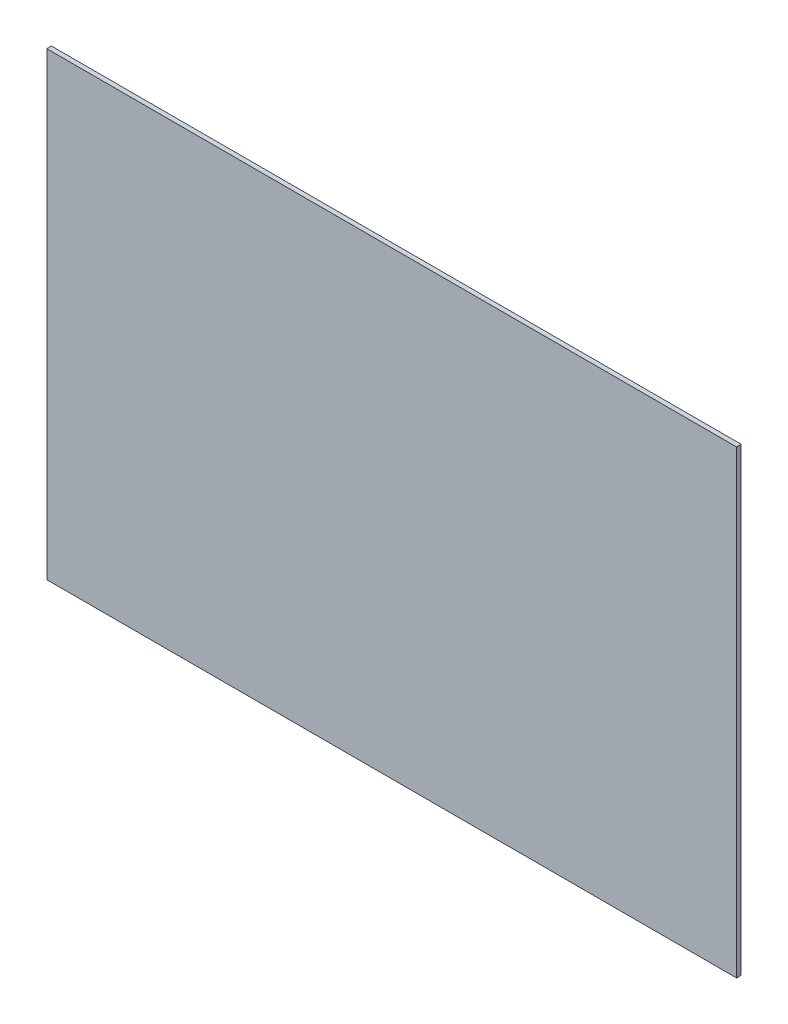
ISO-10303-21;
HEADER;
FILE_DESCRIPTION(('STEP AP214'),'2;1');
FILE_NAME('part.step','',(''),(''),'','','');
FILE_SCHEMA(('AUTOMOTIVE_DESIGN { 1 0 10303 214 1 1 1 1 }'));
ENDSEC;
DATA;
#1=APPLICATION_CONTEXT('core data for automotive mechanical design processes');
#2=APPLICATION_PROTOCOL_DEFINITION('international standard','automotive_design',2000,#1);
#3=PRODUCT_CONTEXT('',#1,'mechanical');
#4=PRODUCT('Part','Part','',(#3));
#5=PRODUCT_RELATED_PRODUCT_CATEGORY('part','',(#4));
#6=PRODUCT_DEFINITION_FORMATION('','',#4);
#7=PRODUCT_DEFINITION_CONTEXT('part definition',#1,'design');
#8=PRODUCT_DEFINITION('design','',#6,#7);
#9=PRODUCT_DEFINITION_SHAPE('','',#8);
#10=(LENGTH_UNIT() NAMED_UNIT(*) SI_UNIT(.MILLI.,.METRE.));
#11=(NAMED_UNIT(*) PLANE_ANGLE_UNIT() SI_UNIT($,.RADIAN.));
#12=(NAMED_UNIT(*) SI_UNIT($,.STERADIAN.) SOLID_ANGLE_UNIT());
#13=UNCERTAINTY_MEASURE_WITH_UNIT(LENGTH_MEASURE(1.E-05),#10,'distance_accuracy_value','');
#14=(GEOMETRIC_REPRESENTATION_CONTEXT(3) GLOBAL_UNCERTAINTY_ASSIGNED_CONTEXT((#13)) GLOBAL_UNIT_ASSIGNED_CONTEXT((#10,
#11,#12)) REPRESENTATION_CONTEXT('',''));
#15=CARTESIAN_POINT('',(0.,0.,0.));
#16=DIRECTION('',(0.,0.,1.));
#17=DIRECTION('',(1.,0.,0.));
#18=AXIS2_PLACEMENT_3D('',#15,#16,#17);
#19=CARTESIAN_POINT('',(0.,0.,2.));
#20=DIRECTION('',(0.,0.,-1.));
#21=DIRECTION('',(-1.,0.,0.));
#22=AXIS2_PLACEMENT_3D('',#19,#20,#21);
#23=PLANE('',#22);
#24=DIRECTION('',(-1.,0.,0.));
#25=VECTOR('',#24,1.);
#26=CARTESIAN_POINT('',(150.000000000003,-100.,2.00000000000589));
#27=LINE('',#26,#25);
#28=CARTESIAN_POINT('',(-150.000000000006,-100.000000000001,2.00000000000475));
#29=VERTEX_POINT('',#28);
#30=CARTESIAN_POINT('',(150.000000000001,-100.,2.00000000000081));
#31=VERTEX_POINT('',#30);
#32=EDGE_CURVE('E79',#29,#31,#27,.F.);
#33=ORIENTED_EDGE('',*,*,#32,.T.);
#34=DIRECTION('',(0.,1.,0.));
#35=VECTOR('',#34,1.);
#36=CARTESIAN_POINT('',(150.,100.,2.));
#37=LINE('',#36,#35);
#38=CARTESIAN_POINT('',(150.000000000001,99.9999999999993,1.99999999999934));
#39=VERTEX_POINT('',#38);
#40=EDGE_CURVE('E54',#31,#39,#37,.T.);
#41=ORIENTED_EDGE('',*,*,#40,.T.);
#42=DIRECTION('',(1.,0.,0.));
#43=VECTOR('',#42,1.);
#44=CARTESIAN_POINT('',(150.,100.,2.));
#45=LINE('',#44,#43);
#46=CARTESIAN_POINT('',(-150.000000000006,99.9999999999989,2.00000000000213));
#47=VERTEX_POINT('',#46);
#48=EDGE_CURVE('E56',#39,#47,#45,.F.);
#49=ORIENTED_EDGE('',*,*,#48,.T.);
#50=DIRECTION('',(0.,1.,0.));
#51=VECTOR('',#50,1.);
#52=CARTESIAN_POINT('',(-150.000000000006,99.9999999999985,2.00000000000589));
#53=LINE('',#52,#51);
#54=EDGE_CURVE('E19',#47,#29,#53,.F.);
#55=ORIENTED_EDGE('',*,*,#54,.T.);
#56=EDGE_LOOP('',(#33,#41,#49,#55));
#57=FACE_BOUND('',#56,.T.);
#58=ADVANCED_FACE('F16',(#57),#23,.F.);
#59=CARTESIAN_POINT('',(-150.000000000006,99.9999999999985,2.00000000000589));
#60=DIRECTION('',(1.,0.,0.));
#61=DIRECTION('',(0.,0.,-1.));
#62=AXIS2_PLACEMENT_3D('',#59,#60,#61);
#63=PLANE('',#62);
#64=DIRECTION('',(0.,0.,1.));
#65=VECTOR('',#64,1.);
#66=CARTESIAN_POINT('',(-150.000000000006,-100.,2.));
#67=LINE('',#66,#65);
#68=CARTESIAN_POINT('',(-150.000000000006,-100.000000000001,3.27307625447305E-12));
#69=VERTEX_POINT('',#68);
#70=EDGE_CURVE('E67',#69,#29,#67,.T.);
#71=ORIENTED_EDGE('',*,*,#70,.T.);
#72=ORIENTED_EDGE('',*,*,#54,.F.);
#73=DIRECTION('',(0.,0.,1.));
#74=VECTOR('',#73,1.);
#75=CARTESIAN_POINT('',(-150.000000000006,100.,2.));
#76=LINE('',#75,#74);
#77=CARTESIAN_POINT('',(-150.000000000006,99.9999999999989,4.74412176210138E-12));
#78=VERTEX_POINT('',#77);
#79=EDGE_CURVE('E62',#47,#78,#76,.F.);
#80=ORIENTED_EDGE('',*,*,#79,.T.);
#81=DIRECTION('',(0.,1.,0.));
#82=VECTOR('',#81,1.);
#83=CARTESIAN_POINT('',(-150.000000000006,0.,1.32394095686553E-12));
#84=LINE('',#83,#82);
#85=EDGE_CURVE('E82',#69,#78,#84,.T.);
#86=ORIENTED_EDGE('',*,*,#85,.F.);
#87=EDGE_LOOP('',(#71,#72,#80,#86));
#88=FACE_BOUND('',#87,.T.);
#89=ADVANCED_FACE('F64',(#88),#63,.F.);
#90=CARTESIAN_POINT('',(150.,100.,2.));
#91=DIRECTION('',(0.,-1.,0.));
#92=DIRECTION('',(1.,0.,0.));
#93=AXIS2_PLACEMENT_3D('',#90,#91,#92);
#94=PLANE('',#93);
#95=ORIENTED_EDGE('',*,*,#79,.F.);
#96=ORIENTED_EDGE('',*,*,#48,.F.);
#97=DIRECTION('',(0.,0.,1.));
#98=VECTOR('',#97,1.);
#99=CARTESIAN_POINT('',(150.,100.,2.));
#100=LINE('',#99,#98);
#101=CARTESIAN_POINT('',(150.000000000001,99.9999999999996,2.61110577604029E-12));
#102=VERTEX_POINT('',#101);
#103=EDGE_CURVE('E74',#39,#102,#100,.F.);
#104=ORIENTED_EDGE('',*,*,#103,.T.);
#105=DIRECTION('',(-1.,0.,0.));
#106=VECTOR('',#105,1.);
#107=CARTESIAN_POINT('',(0.,99.9999999999985,0.));
#108=LINE('',#107,#106);
#109=EDGE_CURVE('E71',#78,#102,#108,.F.);
#110=ORIENTED_EDGE('',*,*,#109,.F.);
#111=EDGE_LOOP('',(#95,#96,#104,#110));
#112=FACE_BOUND('',#111,.T.);
#113=ADVANCED_FACE('F69',(#112),#94,.F.);
#114=CARTESIAN_POINT('',(150.,100.,2.));
#115=DIRECTION('',(-1.,0.,0.));
#116=DIRECTION('',(0.,0.,1.));
#117=AXIS2_PLACEMENT_3D('',#114,#115,#116);
#118=PLANE('',#117);
#119=ORIENTED_EDGE('',*,*,#103,.F.);
#120=ORIENTED_EDGE('',*,*,#40,.F.);
#121=DIRECTION('',(0.,0.,1.));
#122=VECTOR('',#121,1.);
#123=CARTESIAN_POINT('',(150.000000000003,-100.,2.));
#124=LINE('',#123,#122);
#125=CARTESIAN_POINT('',(150.000000000001,-100.,-3.30985239216374E-13));
#126=VERTEX_POINT('',#125);
#127=EDGE_CURVE('E34',#31,#126,#124,.F.);
#128=ORIENTED_EDGE('',*,*,#127,.T.);
#129=DIRECTION('',(0.,1.,0.));
#130=VECTOR('',#129,1.);
#131=CARTESIAN_POINT('',(150.000000000002,0.,-1.3239409568655E-12));
#132=LINE('',#131,#130);
#133=EDGE_CURVE('E25',#102,#126,#132,.F.);
#134=ORIENTED_EDGE('',*,*,#133,.F.);
#135=EDGE_LOOP('',(#119,#120,#128,#134));
#136=FACE_BOUND('',#135,.T.);
#137=ADVANCED_FACE('F88',(#136),#118,.F.);
#138=CARTESIAN_POINT('',(150.000000000003,-100.,2.));
#139=DIRECTION('',(0.,1.,0.));
#140=DIRECTION('',(-1.,0.,0.));
#141=AXIS2_PLACEMENT_3D('',#138,#139,#140);
#142=PLANE('',#141);
#143=ORIENTED_EDGE('',*,*,#127,.F.);
#144=ORIENTED_EDGE('',*,*,#32,.F.);
#145=ORIENTED_EDGE('',*,*,#70,.F.);
#146=DIRECTION('',(-1.,0.,0.));
#147=VECTOR('',#146,1.);
#148=CARTESIAN_POINT('',(0.,-100.,0.));
#149=LINE('',#148,#147);
#150=EDGE_CURVE('E11',#126,#69,#149,.T.);
#151=ORIENTED_EDGE('',*,*,#150,.F.);
#152=EDGE_LOOP('',(#143,#144,#145,#151));
#153=FACE_BOUND('',#152,.T.);
#154=ADVANCED_FACE('F90',(#153),#142,.F.);
#155=CARTESIAN_POINT('',(0.,0.,0.));
#156=DIRECTION('',(0.,0.,-1.));
#157=DIRECTION('',(-1.,0.,0.));
#158=AXIS2_PLACEMENT_3D('',#155,#156,#157);
#159=PLANE('',#158);
#160=ORIENTED_EDGE('',*,*,#133,.T.);
#161=ORIENTED_EDGE('',*,*,#150,.T.);
#162=ORIENTED_EDGE('',*,*,#85,.T.);
#163=ORIENTED_EDGE('',*,*,#109,.T.);
#164=EDGE_LOOP('',(#160,#161,#162,#163));
#165=FACE_BOUND('',#164,.T.);
#166=ADVANCED_FACE('F87',(#165),#159,.T.);
#167=CLOSED_SHELL('',(#58,#89,#113,#137,#154,#166));
#168=MANIFOLD_SOLID_BREP('B1',#167);
#169=ADVANCED_BREP_SHAPE_REPRESENTATION('',(#18,#168),#14);
#170=SHAPE_DEFINITION_REPRESENTATION(#9,#169);
ENDSEC;
END-ISO-10303-21;
